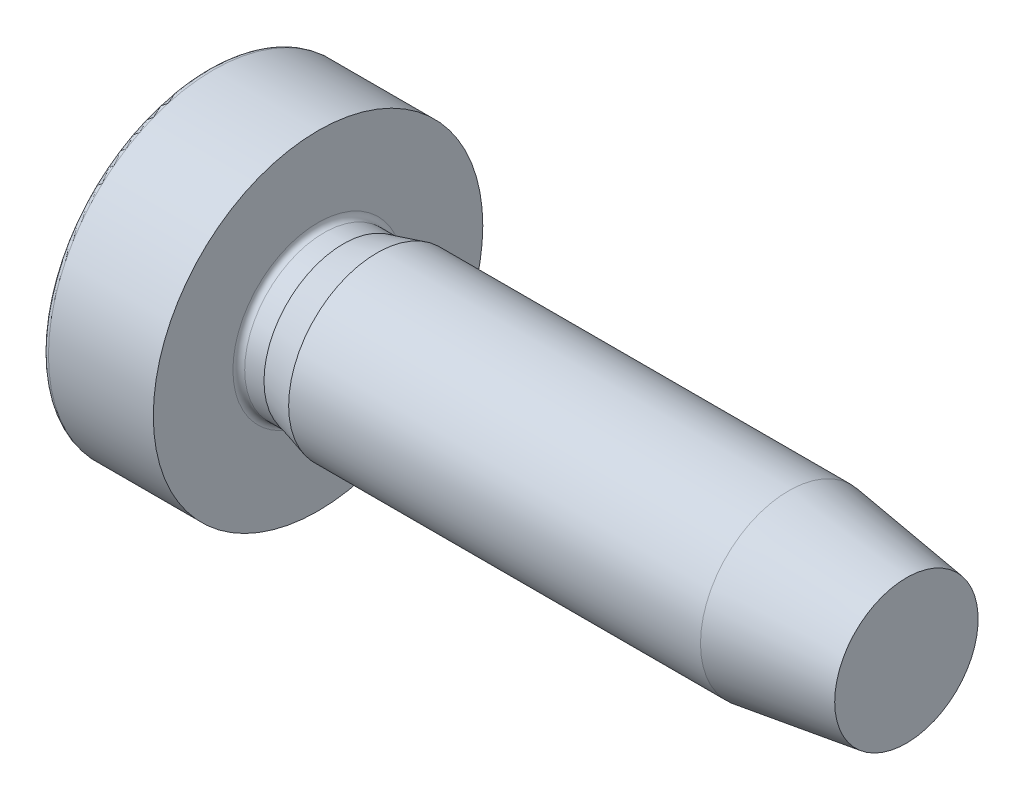
ISO-10303-21;
HEADER;
FILE_DESCRIPTION(('STEP AP214'),'2;1');
FILE_NAME('part.step','',(''),(''),'','','');
FILE_SCHEMA(('AUTOMOTIVE_DESIGN { 1 0 10303 214 1 1 1 1 }'));
ENDSEC;
DATA;
#1=APPLICATION_CONTEXT('core data for automotive mechanical design processes');
#2=APPLICATION_PROTOCOL_DEFINITION('international standard','automotive_design',2000,#1);
#3=PRODUCT_CONTEXT('',#1,'mechanical');
#4=PRODUCT('Part','Part','',(#3));
#5=PRODUCT_RELATED_PRODUCT_CATEGORY('part','',(#4));
#6=PRODUCT_DEFINITION_FORMATION('','',#4);
#7=PRODUCT_DEFINITION_CONTEXT('part definition',#1,'design');
#8=PRODUCT_DEFINITION('design','',#6,#7);
#9=PRODUCT_DEFINITION_SHAPE('','',#8);
#10=(LENGTH_UNIT() NAMED_UNIT(*) SI_UNIT(.MILLI.,.METRE.));
#11=(NAMED_UNIT(*) PLANE_ANGLE_UNIT() SI_UNIT($,.RADIAN.));
#12=(NAMED_UNIT(*) SI_UNIT($,.STERADIAN.) SOLID_ANGLE_UNIT());
#13=UNCERTAINTY_MEASURE_WITH_UNIT(LENGTH_MEASURE(1.E-05),#10,'distance_accuracy_value','');
#14=(GEOMETRIC_REPRESENTATION_CONTEXT(3) GLOBAL_UNCERTAINTY_ASSIGNED_CONTEXT((#13)) GLOBAL_UNIT_ASSIGNED_CONTEXT((#10,
#11,#12)) REPRESENTATION_CONTEXT('',''));
#15=CARTESIAN_POINT('',(0.,0.,0.));
#16=DIRECTION('',(0.,0.,1.));
#17=DIRECTION('',(1.,0.,0.));
#18=AXIS2_PLACEMENT_3D('',#15,#16,#17);
#19=CARTESIAN_POINT('',(5.00000000000024,0.,0.));
#20=DIRECTION('',(-1.,0.,0.));
#21=DIRECTION('',(0.,1.,0.));
#22=AXIS2_PLACEMENT_3D('',#19,#20,#21);
#23=SPHERICAL_SURFACE('',#22,7.40000000000024);
#24=CARTESIAN_POINT('',(-1.8752386130311,0.,0.));
#25=DIRECTION('',(-1.,0.,0.));
#26=DIRECTION('',(0.,0.,1.));
#27=AXIS2_PLACEMENT_3D('',#24,#25,#26);
#28=CIRCLE('',#27,2.7369863013699);
#29=CARTESIAN_POINT('',(-1.8752386130311,0.,2.7369863013699));
#30=VERTEX_POINT('',#29);
#31=EDGE_CURVE('E213',#30,#30,#28,.T.);
#32=ORIENTED_EDGE('',*,*,#31,.T.);
#33=EDGE_LOOP('',(#32));
#34=FACE_BOUND('',#33,.T.);
#35=CARTESIAN_POINT('',(5.00000000000024,0.241915320439594,-0.0211648480717037));
#36=DIRECTION('',(0.,-0.996194698091746,0.0871557427476564));
#37=DIRECTION('',(0.,-0.0871557427476564,-0.996194698091746));
#38=AXIS2_PLACEMENT_3D('',#35,#36,#37);
#39=CIRCLE('',#38,7.39601440148316);
#40=CARTESIAN_POINT('',(-2.23666877782866,0.375,1.5));
#41=VERTEX_POINT('',#40);
#42=CARTESIAN_POINT('',(-2.3696831609114,0.29626020282667,0.6));
#43=VERTEX_POINT('',#42);
#44=EDGE_CURVE('E11',#41,#43,#39,.T.);
#45=ORIENTED_EDGE('',*,*,#44,.F.);
#46=CARTESIAN_POINT('',(5.00000000000024,0.,1.5));
#47=DIRECTION('',(0.,0.,-1.));
#48=DIRECTION('',(-1.,0.,0.));
#49=AXIS2_PLACEMENT_3D('',#46,#47,#48);
#50=CIRCLE('',#49,7.24637840579717);
#51=CARTESIAN_POINT('',(-2.23666877782865,-0.375,1.5));
#52=VERTEX_POINT('',#51);
#53=EDGE_CURVE('E39',#52,#41,#50,.T.);
#54=ORIENTED_EDGE('',*,*,#53,.F.);
#55=CARTESIAN_POINT('',(5.00000000000024,-0.241915320439594,-0.0211648480717069));
#56=DIRECTION('',(0.,0.996194698091746,0.0871557427476564));
#57=DIRECTION('',(0.,-0.0871557427476564,0.996194698091746));
#58=AXIS2_PLACEMENT_3D('',#55,#56,#57);
#59=CIRCLE('',#58,7.39601440148316);
#60=CARTESIAN_POINT('',(-2.3696831609114,-0.29626020282667,0.6));
#61=VERTEX_POINT('',#60);
#62=EDGE_CURVE('E250',#61,#52,#59,.T.);
#63=ORIENTED_EDGE('',*,*,#62,.F.);
#64=CARTESIAN_POINT('',(5.00000000000024,-0.450999830784505,0.15782948978302));
#65=DIRECTION('',(0.,0.943871701028265,-0.330312294651607));
#66=DIRECTION('',(0.,0.330312294651607,0.943871701028265));
#67=AXIS2_PLACEMENT_3D('',#64,#65,#66);
#68=CIRCLE('',#67,7.38455746844662);
#69=CARTESIAN_POINT('',(-2.38097215819163,-0.375,0.375));
#70=VERTEX_POINT('',#69);
#71=EDGE_CURVE('E248',#70,#61,#68,.T.);
#72=ORIENTED_EDGE('',*,*,#71,.F.);
#73=CARTESIAN_POINT('',(5.00000000000024,-0.157829489782998,0.450999830784513));
#74=DIRECTION('',(0.,0.330312294651607,-0.943871701028265));
#75=DIRECTION('',(0.,0.943871701028265,0.330312294651607));
#76=AXIS2_PLACEMENT_3D('',#73,#74,#75);
#77=CIRCLE('',#76,7.38455746844662);
#78=CARTESIAN_POINT('',(-2.3696831609114,-0.6,0.29626020282667));
#79=VERTEX_POINT('',#78);
#80=EDGE_CURVE('E246',#79,#70,#77,.T.);
#81=ORIENTED_EDGE('',*,*,#80,.F.);
#82=CARTESIAN_POINT('',(5.00000000000024,0.0211648480717239,0.241915320439592));
#83=DIRECTION('',(0.,-0.0871557427476564,-0.996194698091746));
#84=DIRECTION('',(0.,0.996194698091746,-0.0871557427476564));
#85=AXIS2_PLACEMENT_3D('',#82,#83,#84);
#86=CIRCLE('',#85,7.39601440148316);
#87=CARTESIAN_POINT('',(-2.23666877782865,-1.5,0.375));
#88=VERTEX_POINT('',#87);
#89=EDGE_CURVE('E244',#88,#79,#86,.T.);
#90=ORIENTED_EDGE('',*,*,#89,.F.);
#91=CARTESIAN_POINT('',(5.00000000000024,-1.5,0.));
#92=DIRECTION('',(0.,1.,0.));
#93=DIRECTION('',(0.,0.,1.));
#94=AXIS2_PLACEMENT_3D('',#91,#92,#93);
#95=CIRCLE('',#94,7.24637840579717);
#96=CARTESIAN_POINT('',(-2.23666877782865,-1.5,-0.375));
#97=VERTEX_POINT('',#96);
#98=EDGE_CURVE('E242',#97,#88,#95,.T.);
#99=ORIENTED_EDGE('',*,*,#98,.F.);
#100=CARTESIAN_POINT('',(5.00000000000024,0.0211648480717239,-0.241915320439592));
#101=DIRECTION('',(0.,-0.0871557427476564,0.996194698091746));
#102=DIRECTION('',(0.,-0.996194698091746,-0.0871557427476564));
#103=AXIS2_PLACEMENT_3D('',#100,#101,#102);
#104=CIRCLE('',#103,7.39601440148316);
#105=CARTESIAN_POINT('',(-2.3696831609114,-0.6,-0.29626020282667));
#106=VERTEX_POINT('',#105);
#107=EDGE_CURVE('E240',#106,#97,#104,.T.);
#108=ORIENTED_EDGE('',*,*,#107,.F.);
#109=CARTESIAN_POINT('',(5.00000000000024,-0.157829489782998,-0.450999830784513));
#110=DIRECTION('',(0.,0.330312294651607,0.943871701028265));
#111=DIRECTION('',(0.,-0.943871701028265,0.330312294651607));
#112=AXIS2_PLACEMENT_3D('',#109,#110,#111);
#113=CIRCLE('',#112,7.38455746844662);
#114=CARTESIAN_POINT('',(-2.38097215819163,-0.375,-0.375));
#115=VERTEX_POINT('',#114);
#116=EDGE_CURVE('E238',#115,#106,#113,.T.);
#117=ORIENTED_EDGE('',*,*,#116,.F.);
#118=CARTESIAN_POINT('',(5.00000000000024,-0.450999830784505,-0.15782948978302));
#119=DIRECTION('',(0.,0.943871701028265,0.330312294651607));
#120=DIRECTION('',(0.,-0.330312294651607,0.943871701028265));
#121=AXIS2_PLACEMENT_3D('',#118,#119,#120);
#122=CIRCLE('',#121,7.38455746844662);
#123=CARTESIAN_POINT('',(-2.3696831609114,-0.29626020282667,-0.6));
#124=VERTEX_POINT('',#123);
#125=EDGE_CURVE('E236',#124,#115,#122,.T.);
#126=ORIENTED_EDGE('',*,*,#125,.F.);
#127=CARTESIAN_POINT('',(5.00000000000024,-0.241915320439594,0.0211648480717069));
#128=DIRECTION('',(0.,0.996194698091746,-0.0871557427476564));
#129=DIRECTION('',(0.,0.0871557427476564,0.996194698091746));
#130=AXIS2_PLACEMENT_3D('',#127,#128,#129);
#131=CIRCLE('',#130,7.39601440148316);
#132=CARTESIAN_POINT('',(-2.23666877782865,-0.375,-1.5));
#133=VERTEX_POINT('',#132);
#134=EDGE_CURVE('E234',#133,#124,#131,.T.);
#135=ORIENTED_EDGE('',*,*,#134,.F.);
#136=CARTESIAN_POINT('',(5.00000000000024,0.,-1.5));
#137=DIRECTION('',(0.,0.,1.));
#138=DIRECTION('',(1.,0.,0.));
#139=AXIS2_PLACEMENT_3D('',#136,#137,#138);
#140=CIRCLE('',#139,7.24637840579717);
#141=CARTESIAN_POINT('',(-2.23666877782865,0.375,-1.5));
#142=VERTEX_POINT('',#141);
#143=EDGE_CURVE('E232',#142,#133,#140,.T.);
#144=ORIENTED_EDGE('',*,*,#143,.F.);
#145=CARTESIAN_POINT('',(5.00000000000024,0.241915320439594,0.0211648480717037));
#146=DIRECTION('',(0.,-0.996194698091746,-0.0871557427476564));
#147=DIRECTION('',(0.,0.0871557427476564,-0.996194698091746));
#148=AXIS2_PLACEMENT_3D('',#145,#146,#147);
#149=CIRCLE('',#148,7.39601440148316);
#150=CARTESIAN_POINT('',(-2.3696831609114,0.29626020282667,-0.6));
#151=VERTEX_POINT('',#150);
#152=EDGE_CURVE('E230',#151,#142,#149,.T.);
#153=ORIENTED_EDGE('',*,*,#152,.F.);
#154=CARTESIAN_POINT('',(5.00000000000024,0.450999830784509,-0.157829489783008));
#155=DIRECTION('',(0.,-0.943871701028265,0.330312294651607));
#156=DIRECTION('',(0.,-0.330312294651607,-0.943871701028265));
#157=AXIS2_PLACEMENT_3D('',#154,#155,#156);
#158=CIRCLE('',#157,7.38455746844662);
#159=CARTESIAN_POINT('',(-2.38097215819163,0.375,-0.375));
#160=VERTEX_POINT('',#159);
#161=EDGE_CURVE('E228',#160,#151,#158,.T.);
#162=ORIENTED_EDGE('',*,*,#161,.F.);
#163=CARTESIAN_POINT('',(5.00000000000024,0.157829489783031,-0.450999830784501));
#164=DIRECTION('',(0.,-0.330312294651607,0.943871701028265));
#165=DIRECTION('',(0.,-0.943871701028265,-0.330312294651607));
#166=AXIS2_PLACEMENT_3D('',#163,#164,#165);
#167=CIRCLE('',#166,7.38455746844662);
#168=CARTESIAN_POINT('',(-2.3696831609114,0.6,-0.29626020282667));
#169=VERTEX_POINT('',#168);
#170=EDGE_CURVE('E226',#169,#160,#167,.T.);
#171=ORIENTED_EDGE('',*,*,#170,.F.);
#172=CARTESIAN_POINT('',(5.00000000000024,-0.0211648480716867,-0.241915320439596));
#173=DIRECTION('',(0.,0.0871557427476564,0.996194698091746));
#174=DIRECTION('',(0.,-0.996194698091746,0.0871557427476564));
#175=AXIS2_PLACEMENT_3D('',#172,#173,#174);
#176=CIRCLE('',#175,7.39601440148316);
#177=CARTESIAN_POINT('',(-2.23666877782866,1.5,-0.375));
#178=VERTEX_POINT('',#177);
#179=EDGE_CURVE('E224',#178,#169,#176,.T.);
#180=ORIENTED_EDGE('',*,*,#179,.F.);
#181=CARTESIAN_POINT('',(5.00000000000024,1.5,0.));
#182=DIRECTION('',(0.,-1.,0.));
#183=DIRECTION('',(0.,0.,-1.));
#184=AXIS2_PLACEMENT_3D('',#181,#182,#183);
#185=CIRCLE('',#184,7.24637840579718);
#186=CARTESIAN_POINT('',(-2.23666877782866,1.5,0.375));
#187=VERTEX_POINT('',#186);
#188=EDGE_CURVE('E222',#187,#178,#185,.T.);
#189=ORIENTED_EDGE('',*,*,#188,.F.);
#190=CARTESIAN_POINT('',(5.00000000000024,-0.0211648480716867,0.241915320439596));
#191=DIRECTION('',(0.,0.0871557427476564,-0.996194698091746));
#192=DIRECTION('',(0.,0.996194698091746,0.0871557427476564));
#193=AXIS2_PLACEMENT_3D('',#190,#191,#192);
#194=CIRCLE('',#193,7.39601440148316);
#195=CARTESIAN_POINT('',(-2.3696831609114,0.6,0.29626020282667));
#196=VERTEX_POINT('',#195);
#197=EDGE_CURVE('E220',#196,#187,#194,.T.);
#198=ORIENTED_EDGE('',*,*,#197,.F.);
#199=CARTESIAN_POINT('',(5.00000000000024,0.157829489783031,0.450999830784501));
#200=DIRECTION('',(0.,-0.330312294651607,-0.943871701028265));
#201=DIRECTION('',(0.,0.943871701028265,-0.330312294651607));
#202=AXIS2_PLACEMENT_3D('',#199,#200,#201);
#203=CIRCLE('',#202,7.38455746844662);
#204=CARTESIAN_POINT('',(-2.38097215819163,0.375,0.375));
#205=VERTEX_POINT('',#204);
#206=EDGE_CURVE('E218',#205,#196,#203,.T.);
#207=ORIENTED_EDGE('',*,*,#206,.F.);
#208=CARTESIAN_POINT('',(5.00000000000024,0.450999830784509,0.157829489783008));
#209=DIRECTION('',(0.,-0.943871701028265,-0.330312294651607));
#210=DIRECTION('',(0.,0.330312294651607,-0.943871701028265));
#211=AXIS2_PLACEMENT_3D('',#208,#209,#210);
#212=CIRCLE('',#211,7.38455746844662);
#213=EDGE_CURVE('E216',#43,#205,#212,.T.);
#214=ORIENTED_EDGE('',*,*,#213,.F.);
#215=EDGE_LOOP('',(#45,#54,#63,#72,#81,#90,#99,#108,#117,#126,#135,#144,#153,#162,#171,#180,
#189,#198,#207,#214));
#216=FACE_BOUND('',#215,.T.);
#217=ADVANCED_FACE('F32',(#34,#216),#23,.T.);
#218=CARTESIAN_POINT('',(-1.78232998312523,0.,0.));
#219=DIRECTION('',(-1.,0.,0.));
#220=DIRECTION('',(0.,0.,1.));
#221=AXIS2_PLACEMENT_3D('',#218,#219,#220);
#222=TOROIDAL_SURFACE('',#221,2.69999999999991,0.100000000000085);
#223=ORIENTED_EDGE('',*,*,#31,.F.);
#224=EDGE_LOOP('',(#223));
#225=FACE_BOUND('',#224,.T.);
#226=CARTESIAN_POINT('',(-1.7823299831253,0.,0.));
#227=DIRECTION('',(-1.,0.,0.));
#228=DIRECTION('',(0.,0.,1.));
#229=AXIS2_PLACEMENT_3D('',#226,#227,#228);
#230=CIRCLE('',#229,2.8);
#231=CARTESIAN_POINT('',(-1.7823299831253,0.,2.8));
#232=VERTEX_POINT('',#231);
#233=EDGE_CURVE('E210',#232,#232,#230,.T.);
#234=ORIENTED_EDGE('',*,*,#233,.T.);
#235=EDGE_LOOP('',(#234));
#236=FACE_BOUND('',#235,.T.);
#237=ADVANCED_FACE('F430',(#225,#236),#222,.T.);
#238=CARTESIAN_POINT('',(13.,0.,0.));
#239=DIRECTION('',(-1.,0.,0.));
#240=DIRECTION('',(0.,0.,1.));
#241=AXIS2_PLACEMENT_3D('',#238,#239,#240);
#242=CYLINDRICAL_SURFACE('',#241,2.8);
#243=ORIENTED_EDGE('',*,*,#233,.F.);
#244=EDGE_LOOP('',(#243));
#245=FACE_BOUND('',#244,.T.);
#246=CARTESIAN_POINT('',(0.,0.,0.));
#247=DIRECTION('',(-1.,0.,0.));
#248=DIRECTION('',(0.,0.,1.));
#249=AXIS2_PLACEMENT_3D('',#246,#247,#248);
#250=CIRCLE('',#249,2.8);
#251=CARTESIAN_POINT('',(0.,0.,2.8));
#252=VERTEX_POINT('',#251);
#253=EDGE_CURVE('E207',#252,#252,#250,.T.);
#254=ORIENTED_EDGE('',*,*,#253,.T.);
#255=EDGE_LOOP('',(#254));
#256=FACE_BOUND('',#255,.T.);
#257=ADVANCED_FACE('F435',(#245,#256),#242,.T.);
#258=CARTESIAN_POINT('',(0.,2.8,0.));
#259=DIRECTION('',(-1.,0.,0.));
#260=DIRECTION('',(0.,0.,1.));
#261=AXIS2_PLACEMENT_3D('',#258,#259,#260);
#262=PLANE('',#261);
#263=ORIENTED_EDGE('',*,*,#253,.F.);
#264=EDGE_LOOP('',(#263));
#265=FACE_BOUND('',#264,.T.);
#266=CARTESIAN_POINT('',(0.,0.,0.));
#267=DIRECTION('',(-1.,0.,0.));
#268=DIRECTION('',(0.,0.,1.));
#269=AXIS2_PLACEMENT_3D('',#266,#267,#268);
#270=CIRCLE('',#269,1.44675);
#271=CARTESIAN_POINT('',(0.,0.,1.44675));
#272=VERTEX_POINT('',#271);
#273=EDGE_CURVE('E204',#272,#272,#270,.T.);
#274=ORIENTED_EDGE('',*,*,#273,.T.);
#275=EDGE_LOOP('',(#274));
#276=FACE_BOUND('',#275,.T.);
#277=ADVANCED_FACE('F443',(#265,#276),#262,.F.);
#278=CARTESIAN_POINT('',(0.0999999999999221,0.,0.));
#279=DIRECTION('',(-1.,0.,0.));
#280=DIRECTION('',(0.,0.,1.));
#281=AXIS2_PLACEMENT_3D('',#278,#279,#280);
#282=TOROIDAL_SURFACE('',#281,1.44674999999992,0.0999999999999222);
#283=ORIENTED_EDGE('',*,*,#273,.F.);
#284=EDGE_LOOP('',(#283));
#285=FACE_BOUND('',#284,.T.);
#286=CARTESIAN_POINT('',(0.0999999999999994,0.,0.));
#287=DIRECTION('',(-1.,0.,0.));
#288=DIRECTION('',(0.,0.,1.));
#289=AXIS2_PLACEMENT_3D('',#286,#287,#288);
#290=CIRCLE('',#289,1.34675);
#291=CARTESIAN_POINT('',(0.0999999999999994,0.,1.34675));
#292=VERTEX_POINT('',#291);
#293=EDGE_CURVE('E201',#292,#292,#290,.T.);
#294=ORIENTED_EDGE('',*,*,#293,.T.);
#295=EDGE_LOOP('',(#294));
#296=FACE_BOUND('',#295,.T.);
#297=ADVANCED_FACE('F449',(#285,#296),#282,.F.);
#298=CARTESIAN_POINT('',(13.,0.,0.));
#299=DIRECTION('',(-1.,0.,0.));
#300=DIRECTION('',(0.,0.,1.));
#301=AXIS2_PLACEMENT_3D('',#298,#299,#300);
#302=CYLINDRICAL_SURFACE('',#301,1.34675);
#303=ORIENTED_EDGE('',*,*,#293,.F.);
#304=EDGE_LOOP('',(#303));
#305=FACE_BOUND('',#304,.T.);
#306=CARTESIAN_POINT('',(0.42806321374007,0.,0.));
#307=DIRECTION('',(-1.,0.,0.));
#308=DIRECTION('',(0.,0.,1.));
#309=AXIS2_PLACEMENT_3D('',#306,#307,#308);
#310=CIRCLE('',#309,1.34675);
#311=CARTESIAN_POINT('',(0.42806321374007,0.,1.34675));
#312=VERTEX_POINT('',#311);
#313=EDGE_CURVE('E198',#312,#312,#310,.T.);
#314=ORIENTED_EDGE('',*,*,#313,.T.);
#315=EDGE_LOOP('',(#314));
#316=FACE_BOUND('',#315,.T.);
#317=ADVANCED_FACE('F455',(#305,#316),#302,.T.);
#318=CARTESIAN_POINT('',(0.999999999999999,0.,0.));
#319=DIRECTION('',(1.,0.,0.));
#320=DIRECTION('',(0.,0.,-1.));
#321=AXIS2_PLACEMENT_3D('',#318,#319,#320);
#322=CONICAL_SURFACE('',#321,1.5,0.26179938779915);
#323=ORIENTED_EDGE('',*,*,#313,.F.);
#324=EDGE_LOOP('',(#323));
#325=FACE_BOUND('',#324,.T.);
#326=CARTESIAN_POINT('',(0.999999999999999,0.,0.));
#327=DIRECTION('',(-1.,0.,0.));
#328=DIRECTION('',(0.,0.,1.));
#329=AXIS2_PLACEMENT_3D('',#326,#327,#328);
#330=CIRCLE('',#329,1.5);
#331=CARTESIAN_POINT('',(0.999999999999999,0.,1.5));
#332=VERTEX_POINT('',#331);
#333=EDGE_CURVE('E195',#332,#332,#330,.T.);
#334=ORIENTED_EDGE('',*,*,#333,.T.);
#335=EDGE_LOOP('',(#334));
#336=FACE_BOUND('',#335,.T.);
#337=ADVANCED_FACE('F461',(#325,#336),#322,.T.);
#338=CARTESIAN_POINT('',(13.,0.,0.));
#339=DIRECTION('',(-1.,0.,0.));
#340=DIRECTION('',(0.,0.,1.));
#341=AXIS2_PLACEMENT_3D('',#338,#339,#340);
#342=CYLINDRICAL_SURFACE('',#341,1.5);
#343=ORIENTED_EDGE('',*,*,#333,.F.);
#344=EDGE_LOOP('',(#343));
#345=FACE_BOUND('',#344,.T.);
#346=CARTESIAN_POINT('',(8.,0.,0.));
#347=DIRECTION('',(-1.,0.,0.));
#348=DIRECTION('',(0.,0.,1.));
#349=AXIS2_PLACEMENT_3D('',#346,#347,#348);
#350=CIRCLE('',#349,1.5);
#351=CARTESIAN_POINT('',(8.,0.,1.5));
#352=VERTEX_POINT('',#351);
#353=EDGE_CURVE('E187',#352,#352,#350,.T.);
#354=ORIENTED_EDGE('',*,*,#353,.T.);
#355=EDGE_LOOP('',(#354));
#356=FACE_BOUND('',#355,.T.);
#357=ADVANCED_FACE('F467',(#345,#356),#342,.T.);
#358=CARTESIAN_POINT('',(10.,0.,0.));
#359=DIRECTION('',(-1.,0.,0.));
#360=DIRECTION('',(0.,0.,1.));
#361=AXIS2_PLACEMENT_3D('',#358,#359,#360);
#362=CONICAL_SURFACE('',#361,1.2189183305952,0.139626340159555);
#363=ORIENTED_EDGE('',*,*,#353,.F.);
#364=EDGE_LOOP('',(#363));
#365=FACE_BOUND('',#364,.T.);
#366=CARTESIAN_POINT('',(10.,0.,0.));
#367=DIRECTION('',(-1.,0.,0.));
#368=DIRECTION('',(0.,0.,1.));
#369=AXIS2_PLACEMENT_3D('',#366,#367,#368);
#370=CIRCLE('',#369,1.2189183305952);
#371=CARTESIAN_POINT('',(10.,0.,1.2189183305952));
#372=VERTEX_POINT('',#371);
#373=EDGE_CURVE('E183',#372,#372,#370,.T.);
#374=ORIENTED_EDGE('',*,*,#373,.T.);
#375=EDGE_LOOP('',(#374));
#376=FACE_BOUND('',#375,.T.);
#377=ADVANCED_FACE('F473',(#365,#376),#362,.T.);
#378=CARTESIAN_POINT('',(10.,1.2189183305952,0.));
#379=DIRECTION('',(-1.,0.,0.));
#380=DIRECTION('',(0.,0.,1.));
#381=AXIS2_PLACEMENT_3D('',#378,#379,#380);
#382=PLANE('',#381);
#383=ORIENTED_EDGE('',*,*,#373,.F.);
#384=EDGE_LOOP('',(#383));
#385=FACE_BOUND('',#384,.T.);
#386=ADVANCED_FACE('F479',(#385),#382,.F.);
#387=CARTESIAN_POINT('',(-1.2,0.29626020282667,0.6));
#388=DIRECTION('',(0.,-0.996194698091746,0.0871557427476564));
#389=DIRECTION('',(0.,-0.0871557427476564,-0.996194698091746));
#390=AXIS2_PLACEMENT_3D('',#387,#388,#389);
#391=PLANE('',#390);
#392=ORIENTED_EDGE('',*,*,#44,.T.);
#393=DIRECTION('',(-1.,0.,0.));
#394=VECTOR('',#393,1.);
#395=CARTESIAN_POINT('',(-1.2,0.29626020282667,0.6));
#396=LINE('',#395,#394);
#397=CARTESIAN_POINT('',(-1.2,0.29626020282667,0.6));
#398=VERTEX_POINT('',#397);
#399=EDGE_CURVE('E46',#398,#43,#396,.T.);
#400=ORIENTED_EDGE('',*,*,#399,.F.);
#401=DIRECTION('',(0.,0.0871557427476564,0.996194698091746));
#402=VECTOR('',#401,1.);
#403=CARTESIAN_POINT('',(-1.2,0.29626020282667,0.6));
#404=LINE('',#403,#402);
#405=CARTESIAN_POINT('',(-1.2,0.375,1.5));
#406=VERTEX_POINT('',#405);
#407=EDGE_CURVE('E172',#398,#406,#404,.T.);
#408=ORIENTED_EDGE('',*,*,#407,.T.);
#409=DIRECTION('',(-1.,0.,0.));
#410=VECTOR('',#409,1.);
#411=CARTESIAN_POINT('',(-1.2,0.375,1.5));
#412=LINE('',#411,#410);
#413=EDGE_CURVE('E179',#406,#41,#412,.T.);
#414=ORIENTED_EDGE('',*,*,#413,.T.);
#415=EDGE_LOOP('',(#392,#400,#408,#414));
#416=FACE_BOUND('',#415,.T.);
#417=ADVANCED_FACE('F178',(#416),#391,.T.);
#418=CARTESIAN_POINT('',(-1.2,0.375,1.5));
#419=DIRECTION('',(0.,0.,-1.));
#420=DIRECTION('',(-1.,0.,0.));
#421=AXIS2_PLACEMENT_3D('',#418,#419,#420);
#422=PLANE('',#421);
#423=ORIENTED_EDGE('',*,*,#53,.T.);
#424=ORIENTED_EDGE('',*,*,#413,.F.);
#425=DIRECTION('',(0.,-1.,0.));
#426=VECTOR('',#425,1.);
#427=CARTESIAN_POINT('',(-1.2,0.375,1.5));
#428=LINE('',#427,#426);
#429=CARTESIAN_POINT('',(-1.2,-0.375,1.5));
#430=VERTEX_POINT('',#429);
#431=EDGE_CURVE('E168',#406,#430,#428,.T.);
#432=ORIENTED_EDGE('',*,*,#431,.T.);
#433=DIRECTION('',(-1.,0.,0.));
#434=VECTOR('',#433,1.);
#435=CARTESIAN_POINT('',(-1.2,-0.375,1.5));
#436=LINE('',#435,#434);
#437=EDGE_CURVE('E184',#430,#52,#436,.T.);
#438=ORIENTED_EDGE('',*,*,#437,.T.);
#439=EDGE_LOOP('',(#423,#424,#432,#438));
#440=FACE_BOUND('',#439,.T.);
#441=ADVANCED_FACE('F182',(#440),#422,.T.);
#442=CARTESIAN_POINT('',(-1.2,-0.375,1.5));
#443=DIRECTION('',(0.,0.996194698091746,0.0871557427476564));
#444=DIRECTION('',(0.,-0.0871557427476564,0.996194698091746));
#445=AXIS2_PLACEMENT_3D('',#442,#443,#444);
#446=PLANE('',#445);
#447=ORIENTED_EDGE('',*,*,#62,.T.);
#448=ORIENTED_EDGE('',*,*,#437,.F.);
#449=DIRECTION('',(0.,0.0871557427476564,-0.996194698091746));
#450=VECTOR('',#449,1.);
#451=CARTESIAN_POINT('',(-1.2,-0.375,1.5));
#452=LINE('',#451,#450);
#453=CARTESIAN_POINT('',(-1.2,-0.29626020282667,0.6));
#454=VERTEX_POINT('',#453);
#455=EDGE_CURVE('E174',#430,#454,#452,.T.);
#456=ORIENTED_EDGE('',*,*,#455,.T.);
#457=DIRECTION('',(-1.,0.,0.));
#458=VECTOR('',#457,1.);
#459=CARTESIAN_POINT('',(-1.2,-0.29626020282667,0.6));
#460=LINE('',#459,#458);
#461=EDGE_CURVE('E189',#454,#61,#460,.T.);
#462=ORIENTED_EDGE('',*,*,#461,.T.);
#463=EDGE_LOOP('',(#447,#448,#456,#462));
#464=FACE_BOUND('',#463,.T.);
#465=ADVANCED_FACE('F254',(#464),#446,.T.);
#466=CARTESIAN_POINT('',(-1.2,-0.29626020282667,0.6));
#467=DIRECTION('',(0.,0.943871701028265,-0.330312294651607));
#468=DIRECTION('',(0.,0.330312294651607,0.943871701028265));
#469=AXIS2_PLACEMENT_3D('',#466,#467,#468);
#470=PLANE('',#469);
#471=ORIENTED_EDGE('',*,*,#71,.T.);
#472=ORIENTED_EDGE('',*,*,#461,.F.);
#473=DIRECTION('',(0.,-0.330312294651607,-0.943871701028265));
#474=VECTOR('',#473,1.);
#475=CARTESIAN_POINT('',(-1.2,-0.29626020282667,0.6));
#476=LINE('',#475,#474);
#477=CARTESIAN_POINT('',(-1.2,-0.375,0.375));
#478=VERTEX_POINT('',#477);
#479=EDGE_CURVE('E322',#454,#478,#476,.T.);
#480=ORIENTED_EDGE('',*,*,#479,.T.);
#481=DIRECTION('',(-1.,0.,0.));
#482=VECTOR('',#481,1.);
#483=CARTESIAN_POINT('',(-1.2,-0.375,0.375));
#484=LINE('',#483,#482);
#485=EDGE_CURVE('E317',#478,#70,#484,.T.);
#486=ORIENTED_EDGE('',*,*,#485,.T.);
#487=EDGE_LOOP('',(#471,#472,#480,#486));
#488=FACE_BOUND('',#487,.T.);
#489=ADVANCED_FACE('F321',(#488),#470,.T.);
#490=CARTESIAN_POINT('',(-1.2,-0.375,0.375));
#491=DIRECTION('',(0.,0.330312294651607,-0.943871701028265));
#492=DIRECTION('',(0.,0.943871701028265,0.330312294651607));
#493=AXIS2_PLACEMENT_3D('',#490,#491,#492);
#494=PLANE('',#493);
#495=ORIENTED_EDGE('',*,*,#80,.T.);
#496=ORIENTED_EDGE('',*,*,#485,.F.);
#497=DIRECTION('',(0.,-0.943871701028265,-0.330312294651607));
#498=VECTOR('',#497,1.);
#499=CARTESIAN_POINT('',(-1.2,-0.375,0.375));
#500=LINE('',#499,#498);
#501=CARTESIAN_POINT('',(-1.2,-0.6,0.29626020282667));
#502=VERTEX_POINT('',#501);
#503=EDGE_CURVE('E330',#478,#502,#500,.T.);
#504=ORIENTED_EDGE('',*,*,#503,.T.);
#505=DIRECTION('',(-1.,0.,0.));
#506=VECTOR('',#505,1.);
#507=CARTESIAN_POINT('',(-1.2,-0.6,0.29626020282667));
#508=LINE('',#507,#506);
#509=EDGE_CURVE('E314',#502,#79,#508,.T.);
#510=ORIENTED_EDGE('',*,*,#509,.T.);
#511=EDGE_LOOP('',(#495,#496,#504,#510));
#512=FACE_BOUND('',#511,.T.);
#513=ADVANCED_FACE('F328',(#512),#494,.T.);
#514=CARTESIAN_POINT('',(-1.2,-0.6,0.29626020282667));
#515=DIRECTION('',(0.,-0.0871557427476564,-0.996194698091746));
#516=DIRECTION('',(0.,0.996194698091746,-0.0871557427476564));
#517=AXIS2_PLACEMENT_3D('',#514,#515,#516);
#518=PLANE('',#517);
#519=ORIENTED_EDGE('',*,*,#89,.T.);
#520=ORIENTED_EDGE('',*,*,#509,.F.);
#521=DIRECTION('',(0.,-0.996194698091746,0.0871557427476564));
#522=VECTOR('',#521,1.);
#523=CARTESIAN_POINT('',(-1.2,-0.6,0.29626020282667));
#524=LINE('',#523,#522);
#525=CARTESIAN_POINT('',(-1.2,-1.5,0.375));
#526=VERTEX_POINT('',#525);
#527=EDGE_CURVE('E334',#502,#526,#524,.T.);
#528=ORIENTED_EDGE('',*,*,#527,.T.);
#529=DIRECTION('',(-1.,0.,0.));
#530=VECTOR('',#529,1.);
#531=CARTESIAN_POINT('',(-1.2,-1.5,0.375));
#532=LINE('',#531,#530);
#533=EDGE_CURVE('E311',#526,#88,#532,.T.);
#534=ORIENTED_EDGE('',*,*,#533,.T.);
#535=EDGE_LOOP('',(#519,#520,#528,#534));
#536=FACE_BOUND('',#535,.T.);
#537=ADVANCED_FACE('F333',(#536),#518,.T.);
#538=CARTESIAN_POINT('',(-1.2,-1.5,0.375));
#539=DIRECTION('',(0.,1.,0.));
#540=DIRECTION('',(0.,0.,1.));
#541=AXIS2_PLACEMENT_3D('',#538,#539,#540);
#542=PLANE('',#541);
#543=ORIENTED_EDGE('',*,*,#98,.T.);
#544=ORIENTED_EDGE('',*,*,#533,.F.);
#545=DIRECTION('',(0.,0.,-1.));
#546=VECTOR('',#545,1.);
#547=CARTESIAN_POINT('',(-1.2,-1.5,0.375));
#548=LINE('',#547,#546);
#549=CARTESIAN_POINT('',(-1.2,-1.5,-0.375));
#550=VERTEX_POINT('',#549);
#551=EDGE_CURVE('E338',#526,#550,#548,.T.);
#552=ORIENTED_EDGE('',*,*,#551,.T.);
#553=DIRECTION('',(-1.,0.,0.));
#554=VECTOR('',#553,1.);
#555=CARTESIAN_POINT('',(-1.2,-1.5,-0.375));
#556=LINE('',#555,#554);
#557=EDGE_CURVE('E308',#550,#97,#556,.T.);
#558=ORIENTED_EDGE('',*,*,#557,.T.);
#559=EDGE_LOOP('',(#543,#544,#552,#558));
#560=FACE_BOUND('',#559,.T.);
#561=ADVANCED_FACE('F420',(#560),#542,.T.);
#562=CARTESIAN_POINT('',(-1.2,-1.5,-0.375));
#563=DIRECTION('',(0.,-0.0871557427476564,0.996194698091746));
#564=DIRECTION('',(0.,-0.996194698091746,-0.0871557427476564));
#565=AXIS2_PLACEMENT_3D('',#562,#563,#564);
#566=PLANE('',#565);
#567=ORIENTED_EDGE('',*,*,#107,.T.);
#568=ORIENTED_EDGE('',*,*,#557,.F.);
#569=DIRECTION('',(0.,0.996194698091746,0.0871557427476564));
#570=VECTOR('',#569,1.);
#571=CARTESIAN_POINT('',(-1.2,-1.5,-0.375));
#572=LINE('',#571,#570);
#573=CARTESIAN_POINT('',(-1.2,-0.6,-0.29626020282667));
#574=VERTEX_POINT('',#573);
#575=EDGE_CURVE('E340',#550,#574,#572,.T.);
#576=ORIENTED_EDGE('',*,*,#575,.T.);
#577=DIRECTION('',(-1.,0.,0.));
#578=VECTOR('',#577,1.);
#579=CARTESIAN_POINT('',(-1.2,-0.6,-0.29626020282667));
#580=LINE('',#579,#578);
#581=EDGE_CURVE('E305',#574,#106,#580,.T.);
#582=ORIENTED_EDGE('',*,*,#581,.T.);
#583=EDGE_LOOP('',(#567,#568,#576,#582));
#584=FACE_BOUND('',#583,.T.);
#585=ADVANCED_FACE('F418',(#584),#566,.T.);
#586=CARTESIAN_POINT('',(-1.2,-0.6,-0.29626020282667));
#587=DIRECTION('',(0.,0.330312294651607,0.943871701028265));
#588=DIRECTION('',(0.,-0.943871701028265,0.330312294651607));
#589=AXIS2_PLACEMENT_3D('',#586,#587,#588);
#590=PLANE('',#589);
#591=ORIENTED_EDGE('',*,*,#116,.T.);
#592=ORIENTED_EDGE('',*,*,#581,.F.);
#593=DIRECTION('',(0.,0.943871701028265,-0.330312294651607));
#594=VECTOR('',#593,1.);
#595=CARTESIAN_POINT('',(-1.2,-0.6,-0.29626020282667));
#596=LINE('',#595,#594);
#597=CARTESIAN_POINT('',(-1.2,-0.375,-0.375));
#598=VERTEX_POINT('',#597);
#599=EDGE_CURVE('E346',#574,#598,#596,.T.);
#600=ORIENTED_EDGE('',*,*,#599,.T.);
#601=DIRECTION('',(-1.,0.,0.));
#602=VECTOR('',#601,1.);
#603=CARTESIAN_POINT('',(-1.2,-0.375,-0.375));
#604=LINE('',#603,#602);
#605=EDGE_CURVE('E302',#598,#115,#604,.T.);
#606=ORIENTED_EDGE('',*,*,#605,.T.);
#607=EDGE_LOOP('',(#591,#592,#600,#606));
#608=FACE_BOUND('',#607,.T.);
#609=ADVANCED_FACE('F413',(#608),#590,.T.);
#610=CARTESIAN_POINT('',(-1.2,-0.375,-0.375));
#611=DIRECTION('',(0.,0.943871701028265,0.330312294651607));
#612=DIRECTION('',(0.,-0.330312294651607,0.943871701028265));
#613=AXIS2_PLACEMENT_3D('',#610,#611,#612);
#614=PLANE('',#613);
#615=ORIENTED_EDGE('',*,*,#125,.T.);
#616=ORIENTED_EDGE('',*,*,#605,.F.);
#617=DIRECTION('',(0.,0.330312294651607,-0.943871701028265));
#618=VECTOR('',#617,1.);
#619=CARTESIAN_POINT('',(-1.2,-0.375,-0.375));
#620=LINE('',#619,#618);
#621=CARTESIAN_POINT('',(-1.2,-0.29626020282667,-0.6));
#622=VERTEX_POINT('',#621);
#623=EDGE_CURVE('E348',#598,#622,#620,.T.);
#624=ORIENTED_EDGE('',*,*,#623,.T.);
#625=DIRECTION('',(-1.,0.,0.));
#626=VECTOR('',#625,1.);
#627=CARTESIAN_POINT('',(-1.2,-0.29626020282667,-0.6));
#628=LINE('',#627,#626);
#629=EDGE_CURVE('E299',#622,#124,#628,.T.);
#630=ORIENTED_EDGE('',*,*,#629,.T.);
#631=EDGE_LOOP('',(#615,#616,#624,#630));
#632=FACE_BOUND('',#631,.T.);
#633=ADVANCED_FACE('F410',(#632),#614,.T.);
#634=CARTESIAN_POINT('',(-1.2,-0.29626020282667,-0.6));
#635=DIRECTION('',(0.,0.996194698091746,-0.0871557427476564));
#636=DIRECTION('',(0.,0.0871557427476564,0.996194698091746));
#637=AXIS2_PLACEMENT_3D('',#634,#635,#636);
#638=PLANE('',#637);
#639=ORIENTED_EDGE('',*,*,#134,.T.);
#640=ORIENTED_EDGE('',*,*,#629,.F.);
#641=DIRECTION('',(0.,-0.0871557427476564,-0.996194698091746));
#642=VECTOR('',#641,1.);
#643=CARTESIAN_POINT('',(-1.2,-0.29626020282667,-0.6));
#644=LINE('',#643,#642);
#645=CARTESIAN_POINT('',(-1.2,-0.375,-1.5));
#646=VERTEX_POINT('',#645);
#647=EDGE_CURVE('E350',#622,#646,#644,.T.);
#648=ORIENTED_EDGE('',*,*,#647,.T.);
#649=DIRECTION('',(-1.,0.,0.));
#650=VECTOR('',#649,1.);
#651=CARTESIAN_POINT('',(-1.2,-0.375,-1.5));
#652=LINE('',#651,#650);
#653=EDGE_CURVE('E296',#646,#133,#652,.T.);
#654=ORIENTED_EDGE('',*,*,#653,.T.);
#655=EDGE_LOOP('',(#639,#640,#648,#654));
#656=FACE_BOUND('',#655,.T.);
#657=ADVANCED_FACE('F403',(#656),#638,.T.);
#658=CARTESIAN_POINT('',(-1.2,-0.375,-1.5));
#659=DIRECTION('',(0.,0.,1.));
#660=DIRECTION('',(1.,0.,0.));
#661=AXIS2_PLACEMENT_3D('',#658,#659,#660);
#662=PLANE('',#661);
#663=ORIENTED_EDGE('',*,*,#143,.T.);
#664=ORIENTED_EDGE('',*,*,#653,.F.);
#665=DIRECTION('',(0.,1.,0.));
#666=VECTOR('',#665,1.);
#667=CARTESIAN_POINT('',(-1.2,-0.375,-1.5));
#668=LINE('',#667,#666);
#669=CARTESIAN_POINT('',(-1.2,0.375,-1.5));
#670=VERTEX_POINT('',#669);
#671=EDGE_CURVE('E352',#646,#670,#668,.T.);
#672=ORIENTED_EDGE('',*,*,#671,.T.);
#673=DIRECTION('',(-1.,0.,0.));
#674=VECTOR('',#673,1.);
#675=CARTESIAN_POINT('',(-1.2,0.375,-1.5));
#676=LINE('',#675,#674);
#677=EDGE_CURVE('E293',#670,#142,#676,.T.);
#678=ORIENTED_EDGE('',*,*,#677,.T.);
#679=EDGE_LOOP('',(#663,#664,#672,#678));
#680=FACE_BOUND('',#679,.T.);
#681=ADVANCED_FACE('F401',(#680),#662,.T.);
#682=CARTESIAN_POINT('',(-1.2,0.375,-1.5));
#683=DIRECTION('',(0.,-0.996194698091746,-0.0871557427476564));
#684=DIRECTION('',(0.,0.0871557427476564,-0.996194698091746));
#685=AXIS2_PLACEMENT_3D('',#682,#683,#684);
#686=PLANE('',#685);
#687=ORIENTED_EDGE('',*,*,#152,.T.);
#688=ORIENTED_EDGE('',*,*,#677,.F.);
#689=DIRECTION('',(0.,-0.0871557427476564,0.996194698091746));
#690=VECTOR('',#689,1.);
#691=CARTESIAN_POINT('',(-1.2,0.375,-1.5));
#692=LINE('',#691,#690);
#693=CARTESIAN_POINT('',(-1.2,0.29626020282667,-0.6));
#694=VERTEX_POINT('',#693);
#695=EDGE_CURVE('E354',#670,#694,#692,.T.);
#696=ORIENTED_EDGE('',*,*,#695,.T.);
#697=DIRECTION('',(-1.,0.,0.));
#698=VECTOR('',#697,1.);
#699=CARTESIAN_POINT('',(-1.2,0.29626020282667,-0.6));
#700=LINE('',#699,#698);
#701=EDGE_CURVE('E290',#694,#151,#700,.T.);
#702=ORIENTED_EDGE('',*,*,#701,.T.);
#703=EDGE_LOOP('',(#687,#688,#696,#702));
#704=FACE_BOUND('',#703,.T.);
#705=ADVANCED_FACE('F394',(#704),#686,.T.);
#706=CARTESIAN_POINT('',(-1.2,0.29626020282667,-0.6));
#707=DIRECTION('',(0.,-0.943871701028265,0.330312294651607));
#708=DIRECTION('',(0.,-0.330312294651607,-0.943871701028265));
#709=AXIS2_PLACEMENT_3D('',#706,#707,#708);
#710=PLANE('',#709);
#711=ORIENTED_EDGE('',*,*,#161,.T.);
#712=ORIENTED_EDGE('',*,*,#701,.F.);
#713=DIRECTION('',(0.,0.330312294651607,0.943871701028265));
#714=VECTOR('',#713,1.);
#715=CARTESIAN_POINT('',(-1.2,0.29626020282667,-0.6));
#716=LINE('',#715,#714);
#717=CARTESIAN_POINT('',(-1.2,0.375,-0.375));
#718=VERTEX_POINT('',#717);
#719=EDGE_CURVE('E356',#694,#718,#716,.T.);
#720=ORIENTED_EDGE('',*,*,#719,.T.);
#721=DIRECTION('',(-1.,0.,0.));
#722=VECTOR('',#721,1.);
#723=CARTESIAN_POINT('',(-1.2,0.375,-0.375));
#724=LINE('',#723,#722);
#725=EDGE_CURVE('E287',#718,#160,#724,.T.);
#726=ORIENTED_EDGE('',*,*,#725,.T.);
#727=EDGE_LOOP('',(#711,#712,#720,#726));
#728=FACE_BOUND('',#727,.T.);
#729=ADVANCED_FACE('F391',(#728),#710,.T.);
#730=CARTESIAN_POINT('',(-1.2,0.375,-0.375));
#731=DIRECTION('',(0.,-0.330312294651607,0.943871701028265));
#732=DIRECTION('',(0.,-0.943871701028265,-0.330312294651607));
#733=AXIS2_PLACEMENT_3D('',#730,#731,#732);
#734=PLANE('',#733);
#735=ORIENTED_EDGE('',*,*,#170,.T.);
#736=ORIENTED_EDGE('',*,*,#725,.F.);
#737=DIRECTION('',(0.,0.943871701028265,0.330312294651607));
#738=VECTOR('',#737,1.);
#739=CARTESIAN_POINT('',(-1.2,0.375,-0.375));
#740=LINE('',#739,#738);
#741=CARTESIAN_POINT('',(-1.2,0.6,-0.29626020282667));
#742=VERTEX_POINT('',#741);
#743=EDGE_CURVE('E358',#718,#742,#740,.T.);
#744=ORIENTED_EDGE('',*,*,#743,.T.);
#745=DIRECTION('',(-1.,0.,0.));
#746=VECTOR('',#745,1.);
#747=CARTESIAN_POINT('',(-1.2,0.6,-0.29626020282667));
#748=LINE('',#747,#746);
#749=EDGE_CURVE('E284',#742,#169,#748,.T.);
#750=ORIENTED_EDGE('',*,*,#749,.T.);
#751=EDGE_LOOP('',(#735,#736,#744,#750));
#752=FACE_BOUND('',#751,.T.);
#753=ADVANCED_FACE('F383',(#752),#734,.T.);
#754=CARTESIAN_POINT('',(-1.2,0.6,-0.29626020282667));
#755=DIRECTION('',(0.,0.0871557427476564,0.996194698091746));
#756=DIRECTION('',(0.,-0.996194698091746,0.0871557427476564));
#757=AXIS2_PLACEMENT_3D('',#754,#755,#756);
#758=PLANE('',#757);
#759=ORIENTED_EDGE('',*,*,#179,.T.);
#760=ORIENTED_EDGE('',*,*,#749,.F.);
#761=DIRECTION('',(0.,0.996194698091746,-0.0871557427476564));
#762=VECTOR('',#761,1.);
#763=CARTESIAN_POINT('',(-1.2,0.6,-0.29626020282667));
#764=LINE('',#763,#762);
#765=CARTESIAN_POINT('',(-1.2,1.5,-0.375));
#766=VERTEX_POINT('',#765);
#767=EDGE_CURVE('E360',#742,#766,#764,.T.);
#768=ORIENTED_EDGE('',*,*,#767,.T.);
#769=DIRECTION('',(-1.,0.,0.));
#770=VECTOR('',#769,1.);
#771=CARTESIAN_POINT('',(-1.2,1.5,-0.375));
#772=LINE('',#771,#770);
#773=EDGE_CURVE('E281',#766,#178,#772,.T.);
#774=ORIENTED_EDGE('',*,*,#773,.T.);
#775=EDGE_LOOP('',(#759,#760,#768,#774));
#776=FACE_BOUND('',#775,.T.);
#777=ADVANCED_FACE('F381',(#776),#758,.T.);
#778=CARTESIAN_POINT('',(-1.2,1.5,-0.375));
#779=DIRECTION('',(0.,-1.,0.));
#780=DIRECTION('',(0.,0.,-1.));
#781=AXIS2_PLACEMENT_3D('',#778,#779,#780);
#782=PLANE('',#781);
#783=ORIENTED_EDGE('',*,*,#188,.T.);
#784=ORIENTED_EDGE('',*,*,#773,.F.);
#785=DIRECTION('',(0.,0.,1.));
#786=VECTOR('',#785,1.);
#787=CARTESIAN_POINT('',(-1.2,1.5,-0.375));
#788=LINE('',#787,#786);
#789=CARTESIAN_POINT('',(-1.2,1.5,0.375));
#790=VERTEX_POINT('',#789);
#791=EDGE_CURVE('E362',#766,#790,#788,.T.);
#792=ORIENTED_EDGE('',*,*,#791,.T.);
#793=DIRECTION('',(-1.,0.,0.));
#794=VECTOR('',#793,1.);
#795=CARTESIAN_POINT('',(-1.2,1.5,0.375));
#796=LINE('',#795,#794);
#797=EDGE_CURVE('E273',#790,#187,#796,.T.);
#798=ORIENTED_EDGE('',*,*,#797,.T.);
#799=EDGE_LOOP('',(#783,#784,#792,#798));
#800=FACE_BOUND('',#799,.T.);
#801=ADVANCED_FACE('F374',(#800),#782,.T.);
#802=CARTESIAN_POINT('',(-1.2,1.5,0.375));
#803=DIRECTION('',(0.,0.0871557427476564,-0.996194698091746));
#804=DIRECTION('',(0.,0.996194698091746,0.0871557427476564));
#805=AXIS2_PLACEMENT_3D('',#802,#803,#804);
#806=PLANE('',#805);
#807=ORIENTED_EDGE('',*,*,#197,.T.);
#808=ORIENTED_EDGE('',*,*,#797,.F.);
#809=DIRECTION('',(0.,-0.996194698091746,-0.0871557427476564));
#810=VECTOR('',#809,1.);
#811=CARTESIAN_POINT('',(-1.2,1.5,0.375));
#812=LINE('',#811,#810);
#813=CARTESIAN_POINT('',(-1.2,0.6,0.29626020282667));
#814=VERTEX_POINT('',#813);
#815=EDGE_CURVE('E364',#790,#814,#812,.T.);
#816=ORIENTED_EDGE('',*,*,#815,.T.);
#817=DIRECTION('',(-1.,0.,0.));
#818=VECTOR('',#817,1.);
#819=CARTESIAN_POINT('',(-1.2,0.6,0.29626020282667));
#820=LINE('',#819,#818);
#821=EDGE_CURVE('E271',#814,#196,#820,.T.);
#822=ORIENTED_EDGE('',*,*,#821,.T.);
#823=EDGE_LOOP('',(#807,#808,#816,#822));
#824=FACE_BOUND('',#823,.T.);
#825=ADVANCED_FACE('F371',(#824),#806,.T.);
#826=CARTESIAN_POINT('',(-1.2,0.6,0.29626020282667));
#827=DIRECTION('',(0.,-0.330312294651607,-0.943871701028265));
#828=DIRECTION('',(0.,0.943871701028265,-0.330312294651607));
#829=AXIS2_PLACEMENT_3D('',#826,#827,#828);
#830=PLANE('',#829);
#831=ORIENTED_EDGE('',*,*,#206,.T.);
#832=ORIENTED_EDGE('',*,*,#821,.F.);
#833=DIRECTION('',(0.,-0.943871701028265,0.330312294651607));
#834=VECTOR('',#833,1.);
#835=CARTESIAN_POINT('',(-1.2,0.6,0.29626020282667));
#836=LINE('',#835,#834);
#837=CARTESIAN_POINT('',(-1.2,0.375,0.375));
#838=VERTEX_POINT('',#837);
#839=EDGE_CURVE('E270',#814,#838,#836,.T.);
#840=ORIENTED_EDGE('',*,*,#839,.T.);
#841=DIRECTION('',(-1.,0.,0.));
#842=VECTOR('',#841,1.);
#843=CARTESIAN_POINT('',(-1.2,0.375,0.375));
#844=LINE('',#843,#842);
#845=EDGE_CURVE('E264',#838,#205,#844,.T.);
#846=ORIENTED_EDGE('',*,*,#845,.T.);
#847=EDGE_LOOP('',(#831,#832,#840,#846));
#848=FACE_BOUND('',#847,.T.);
#849=ADVANCED_FACE('F266',(#848),#830,.T.);
#850=CARTESIAN_POINT('',(-1.2,0.375,0.375));
#851=DIRECTION('',(0.,-0.943871701028265,-0.330312294651607));
#852=DIRECTION('',(0.,0.330312294651607,-0.943871701028265));
#853=AXIS2_PLACEMENT_3D('',#850,#851,#852);
#854=PLANE('',#853);
#855=ORIENTED_EDGE('',*,*,#213,.T.);
#856=ORIENTED_EDGE('',*,*,#845,.F.);
#857=DIRECTION('',(0.,-0.330312294651607,0.943871701028265));
#858=VECTOR('',#857,1.);
#859=CARTESIAN_POINT('',(-1.2,0.375,0.375));
#860=LINE('',#859,#858);
#861=EDGE_CURVE('E275',#838,#398,#860,.T.);
#862=ORIENTED_EDGE('',*,*,#861,.T.);
#863=ORIENTED_EDGE('',*,*,#399,.T.);
#864=EDGE_LOOP('',(#855,#856,#862,#863));
#865=FACE_BOUND('',#864,.T.);
#866=ADVANCED_FACE('F263',(#865),#854,.T.);
#867=CARTESIAN_POINT('',(-1.2,0.,0.));
#868=DIRECTION('',(1.,0.,0.));
#869=DIRECTION('',(0.,0.,-1.));
#870=AXIS2_PLACEMENT_3D('',#867,#868,#869);
#871=PLANE('',#870);
#872=ORIENTED_EDGE('',*,*,#407,.F.);
#873=ORIENTED_EDGE('',*,*,#861,.F.);
#874=ORIENTED_EDGE('',*,*,#839,.F.);
#875=ORIENTED_EDGE('',*,*,#815,.F.);
#876=ORIENTED_EDGE('',*,*,#791,.F.);
#877=ORIENTED_EDGE('',*,*,#767,.F.);
#878=ORIENTED_EDGE('',*,*,#743,.F.);
#879=ORIENTED_EDGE('',*,*,#719,.F.);
#880=ORIENTED_EDGE('',*,*,#695,.F.);
#881=ORIENTED_EDGE('',*,*,#671,.F.);
#882=ORIENTED_EDGE('',*,*,#647,.F.);
#883=ORIENTED_EDGE('',*,*,#623,.F.);
#884=ORIENTED_EDGE('',*,*,#599,.F.);
#885=ORIENTED_EDGE('',*,*,#575,.F.);
#886=ORIENTED_EDGE('',*,*,#551,.F.);
#887=ORIENTED_EDGE('',*,*,#527,.F.);
#888=ORIENTED_EDGE('',*,*,#503,.F.);
#889=ORIENTED_EDGE('',*,*,#479,.F.);
#890=ORIENTED_EDGE('',*,*,#455,.F.);
#891=ORIENTED_EDGE('',*,*,#431,.F.);
#892=EDGE_LOOP('',(#872,#873,#874,#875,#876,#877,#878,#879,#880,#881,#882,#883,#884,#885,#886,
#887,#888,#889,#890,#891));
#893=FACE_BOUND('',#892,.T.);
#894=ADVANCED_FACE('F170',(#893),#871,.F.);
#895=CLOSED_SHELL('',(#217,#237,#257,#277,#297,#317,#337,#357,#377,#386,#417,#441,#465,#489,
#513,#537,#561,#585,#609,#633,#657,#681,#705,#729,#753,#777,#801,#825,#849,#866,#894));
#896=MANIFOLD_SOLID_BREP('B2',#895);
#897=ADVANCED_BREP_SHAPE_REPRESENTATION('',(#18,#896),#14);
#898=SHAPE_DEFINITION_REPRESENTATION(#9,#897);
ENDSEC;
END-ISO-10303-21;
